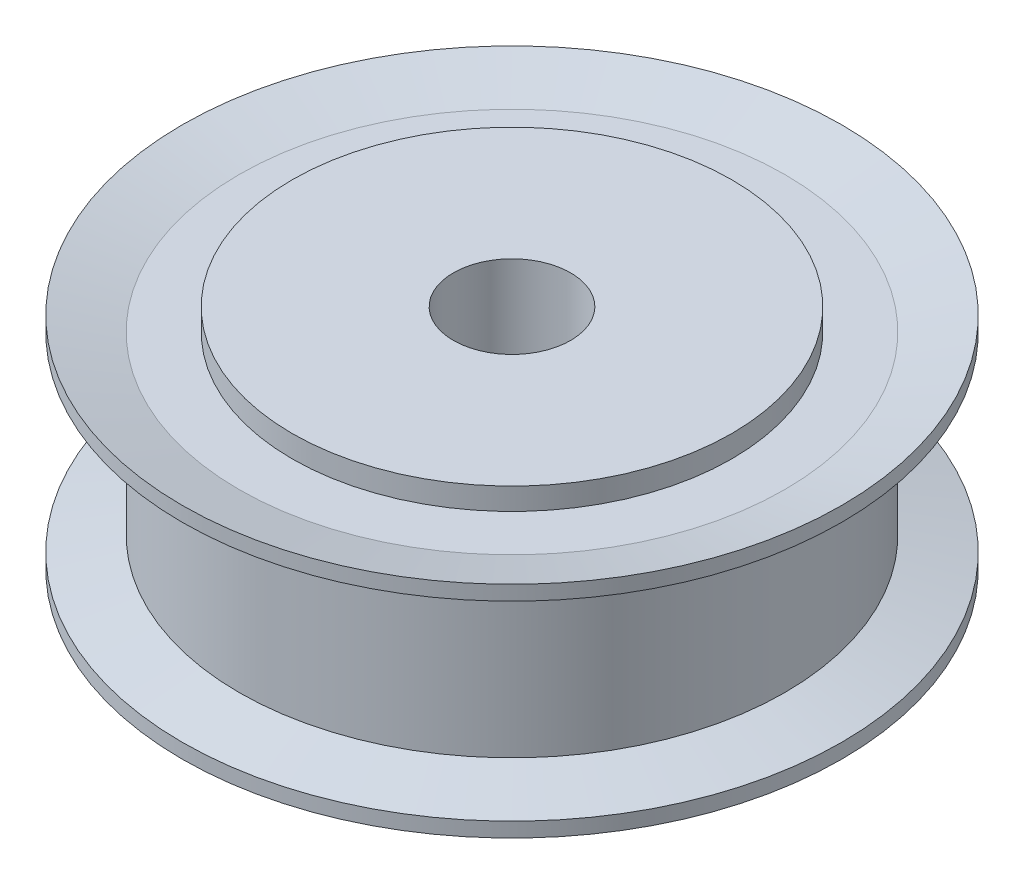
ISO-10303-21;
HEADER;
FILE_DESCRIPTION(('STEP AP214'),'2;1');
FILE_NAME('part.step','',(''),(''),'','','');
FILE_SCHEMA(('AUTOMOTIVE_DESIGN { 1 0 10303 214 1 1 1 1 }'));
ENDSEC;
DATA;
#1=APPLICATION_CONTEXT('core data for automotive mechanical design processes');
#2=APPLICATION_PROTOCOL_DEFINITION('international standard','automotive_design',2000,#1);
#3=PRODUCT_CONTEXT('',#1,'mechanical');
#4=PRODUCT('Part','Part','',(#3));
#5=PRODUCT_RELATED_PRODUCT_CATEGORY('part','',(#4));
#6=PRODUCT_DEFINITION_FORMATION('','',#4);
#7=PRODUCT_DEFINITION_CONTEXT('part definition',#1,'design');
#8=PRODUCT_DEFINITION('design','',#6,#7);
#9=PRODUCT_DEFINITION_SHAPE('','',#8);
#10=(LENGTH_UNIT() NAMED_UNIT(*) SI_UNIT(.MILLI.,.METRE.));
#11=(NAMED_UNIT(*) PLANE_ANGLE_UNIT() SI_UNIT($,.RADIAN.));
#12=(NAMED_UNIT(*) SI_UNIT($,.STERADIAN.) SOLID_ANGLE_UNIT());
#13=UNCERTAINTY_MEASURE_WITH_UNIT(LENGTH_MEASURE(1.E-05),#10,'distance_accuracy_value','');
#14=(GEOMETRIC_REPRESENTATION_CONTEXT(3) GLOBAL_UNCERTAINTY_ASSIGNED_CONTEXT((#13)) GLOBAL_UNIT_ASSIGNED_CONTEXT((#10,
#11,#12)) REPRESENTATION_CONTEXT('',''));
#15=CARTESIAN_POINT('',(0.,0.,0.));
#16=DIRECTION('',(0.,0.,1.));
#17=DIRECTION('',(1.,0.,0.));
#18=AXIS2_PLACEMENT_3D('',#15,#16,#17);
#19=CARTESIAN_POINT('',(0.,49.340027700831,0.));
#20=DIRECTION('',(0.,1.,0.));
#21=DIRECTION('',(0.,0.,1.));
#22=AXIS2_PLACEMENT_3D('',#19,#20,#21);
#23=CYLINDRICAL_SURFACE('',#22,15.);
#24=CARTESIAN_POINT('',(0.,8.,0.));
#25=DIRECTION('',(0.,1.,0.));
#26=DIRECTION('',(0.,0.,1.));
#27=AXIS2_PLACEMENT_3D('',#24,#25,#26);
#28=CIRCLE('',#27,15.);
#29=CARTESIAN_POINT('',(0.,8.,15.));
#30=VERTEX_POINT('',#29);
#31=EDGE_CURVE('E41',#30,#30,#28,.T.);
#32=ORIENTED_EDGE('',*,*,#31,.F.);
#33=EDGE_LOOP('',(#32));
#34=FACE_BOUND('',#33,.T.);
#35=CARTESIAN_POINT('',(0.,6.50000000000001,0.));
#36=DIRECTION('',(0.,-1.,0.));
#37=DIRECTION('',(1.,0.,0.));
#38=AXIS2_PLACEMENT_3D('',#35,#36,#37);
#39=CIRCLE('',#38,15.);
#40=CARTESIAN_POINT('',(15.,6.50000000000001,0.));
#41=VERTEX_POINT('',#40);
#42=EDGE_CURVE('E10',#41,#41,#39,.T.);
#43=ORIENTED_EDGE('',*,*,#42,.F.);
#44=EDGE_LOOP('',(#43));
#45=FACE_BOUND('',#44,.T.);
#46=ADVANCED_FACE('F30',(#34,#45),#23,.T.);
#47=CARTESIAN_POINT('',(0.,49.340027700831,0.));
#48=DIRECTION('',(0.,1.,0.));
#49=DIRECTION('',(0.,0.,1.));
#50=AXIS2_PLACEMENT_3D('',#47,#48,#49);
#51=CYLINDRICAL_SURFACE('',#50,15.);
#52=CARTESIAN_POINT('',(0.,-8.,0.));
#53=DIRECTION('',(0.,1.,0.));
#54=DIRECTION('',(0.,0.,1.));
#55=AXIS2_PLACEMENT_3D('',#52,#53,#54);
#56=CIRCLE('',#55,15.);
#57=CARTESIAN_POINT('',(0.,-8.,15.));
#58=VERTEX_POINT('',#57);
#59=EDGE_CURVE('E50',#58,#58,#56,.T.);
#60=ORIENTED_EDGE('',*,*,#59,.T.);
#61=EDGE_LOOP('',(#60));
#62=FACE_BOUND('',#61,.T.);
#63=CARTESIAN_POINT('',(0.,-6.50000000000001,0.));
#64=DIRECTION('',(0.,1.,0.));
#65=DIRECTION('',(-1.,0.,0.));
#66=AXIS2_PLACEMENT_3D('',#63,#64,#65);
#67=CIRCLE('',#66,15.);
#68=CARTESIAN_POINT('',(-15.,-6.50000000000001,0.));
#69=VERTEX_POINT('',#68);
#70=EDGE_CURVE('E37',#69,#69,#67,.T.);
#71=ORIENTED_EDGE('',*,*,#70,.F.);
#72=EDGE_LOOP('',(#71));
#73=FACE_BOUND('',#72,.T.);
#74=ADVANCED_FACE('F95',(#62,#73),#51,.T.);
#75=CARTESIAN_POINT('',(15.,8.,0.));
#76=DIRECTION('',(0.,-1.,0.));
#77=DIRECTION('',(0.,0.,-1.));
#78=AXIS2_PLACEMENT_3D('',#75,#76,#77);
#79=PLANE('',#78);
#80=CARTESIAN_POINT('',(0.,7.99999999999999,0.));
#81=DIRECTION('',(0.,1.,0.));
#82=DIRECTION('',(0.,0.,1.));
#83=AXIS2_PLACEMENT_3D('',#80,#81,#82);
#84=CIRCLE('',#83,4.00000000000001);
#85=CARTESIAN_POINT('',(0.,7.99999999999999,4.00000000000001));
#86=VERTEX_POINT('',#85);
#87=EDGE_CURVE('E56',#86,#86,#84,.T.);
#88=ORIENTED_EDGE('',*,*,#87,.F.);
#89=EDGE_LOOP('',(#88));
#90=FACE_BOUND('',#89,.T.);
#91=ORIENTED_EDGE('',*,*,#31,.T.);
#92=EDGE_LOOP('',(#91));
#93=FACE_BOUND('',#92,.T.);
#94=ADVANCED_FACE('F32',(#90,#93),#79,.F.);
#95=CARTESIAN_POINT('',(0.,49.340027700831,0.));
#96=DIRECTION('',(0.,1.,0.));
#97=DIRECTION('',(0.,0.,1.));
#98=AXIS2_PLACEMENT_3D('',#95,#96,#97);
#99=CYLINDRICAL_SURFACE('',#98,18.62);
#100=CARTESIAN_POINT('',(0.,5.5,0.));
#101=DIRECTION('',(0.,1.,0.));
#102=DIRECTION('',(0.,0.,1.));
#103=AXIS2_PLACEMENT_3D('',#100,#101,#102);
#104=CIRCLE('',#103,18.62);
#105=CARTESIAN_POINT('',(0.,5.5,18.62));
#106=VERTEX_POINT('',#105);
#107=EDGE_CURVE('E45',#106,#106,#104,.T.);
#108=ORIENTED_EDGE('',*,*,#107,.F.);
#109=EDGE_LOOP('',(#108));
#110=FACE_BOUND('',#109,.T.);
#111=CARTESIAN_POINT('',(0.,-5.5,0.));
#112=DIRECTION('',(0.,-1.,0.));
#113=DIRECTION('',(1.,0.,0.));
#114=AXIS2_PLACEMENT_3D('',#111,#112,#113);
#115=CIRCLE('',#114,18.62);
#116=CARTESIAN_POINT('',(18.62,-5.5,0.));
#117=VERTEX_POINT('',#116);
#118=EDGE_CURVE('E62',#117,#117,#115,.T.);
#119=ORIENTED_EDGE('',*,*,#118,.F.);
#120=EDGE_LOOP('',(#119));
#121=FACE_BOUND('',#120,.T.);
#122=ADVANCED_FACE('F105',(#110,#121),#99,.T.);
#123=CARTESIAN_POINT('',(15.,-8.,0.));
#124=DIRECTION('',(0.,1.,0.));
#125=DIRECTION('',(0.,0.,1.));
#126=AXIS2_PLACEMENT_3D('',#123,#124,#125);
#127=PLANE('',#126);
#128=ORIENTED_EDGE('',*,*,#59,.F.);
#129=EDGE_LOOP('',(#128));
#130=FACE_BOUND('',#129,.T.);
#131=CARTESIAN_POINT('',(0.,-8.,0.));
#132=DIRECTION('',(0.,1.,0.));
#133=DIRECTION('',(0.,0.,1.));
#134=AXIS2_PLACEMENT_3D('',#131,#132,#133);
#135=CIRCLE('',#134,4.00000000000001);
#136=CARTESIAN_POINT('',(0.,-8.,4.00000000000001));
#137=VERTEX_POINT('',#136);
#138=EDGE_CURVE('E53',#137,#137,#135,.T.);
#139=ORIENTED_EDGE('',*,*,#138,.T.);
#140=EDGE_LOOP('',(#139));
#141=FACE_BOUND('',#140,.T.);
#142=ADVANCED_FACE('F107',(#130,#141),#127,.F.);
#143=CARTESIAN_POINT('',(0.,49.340027700831,0.));
#144=DIRECTION('',(0.,1.,0.));
#145=DIRECTION('',(0.,0.,1.));
#146=AXIS2_PLACEMENT_3D('',#143,#144,#145);
#147=CYLINDRICAL_SURFACE('',#146,4.00000000000001);
#148=ORIENTED_EDGE('',*,*,#138,.F.);
#149=EDGE_LOOP('',(#148));
#150=FACE_BOUND('',#149,.T.);
#151=ORIENTED_EDGE('',*,*,#87,.T.);
#152=EDGE_LOOP('',(#151));
#153=FACE_BOUND('',#152,.T.);
#154=ADVANCED_FACE('F112',(#150,#153),#147,.F.);
#155=CARTESIAN_POINT('',(0.,0.,0.));
#156=DIRECTION('',(0.,-1.,0.));
#157=DIRECTION('',(1.,0.,0.));
#158=AXIS2_PLACEMENT_3D('',#155,#156,#157);
#159=CYLINDRICAL_SURFACE('',#158,22.5);
#160=CARTESIAN_POINT('',(0.,-7.5,0.));
#161=DIRECTION('',(0.,-1.,0.));
#162=DIRECTION('',(1.,0.,0.));
#163=AXIS2_PLACEMENT_3D('',#160,#161,#162);
#164=CIRCLE('',#163,22.5);
#165=CARTESIAN_POINT('',(22.5,-7.5,0.));
#166=VERTEX_POINT('',#165);
#167=EDGE_CURVE('E68',#166,#166,#164,.T.);
#168=ORIENTED_EDGE('',*,*,#167,.F.);
#169=EDGE_LOOP('',(#168));
#170=FACE_BOUND('',#169,.T.);
#171=CARTESIAN_POINT('',(0.,-6.5,0.));
#172=DIRECTION('',(0.,-1.,0.));
#173=DIRECTION('',(1.,0.,0.));
#174=AXIS2_PLACEMENT_3D('',#171,#172,#173);
#175=CIRCLE('',#174,22.5);
#176=CARTESIAN_POINT('',(22.5,-6.5,0.));
#177=VERTEX_POINT('',#176);
#178=EDGE_CURVE('E59',#177,#177,#175,.T.);
#179=ORIENTED_EDGE('',*,*,#178,.T.);
#180=EDGE_LOOP('',(#179));
#181=FACE_BOUND('',#180,.T.);
#182=ADVANCED_FACE('F116',(#170,#181),#159,.T.);
#183=CARTESIAN_POINT('',(0.,-5.5,0.));
#184=DIRECTION('',(0.,-1.,0.));
#185=DIRECTION('',(1.,0.,0.));
#186=AXIS2_PLACEMENT_3D('',#183,#184,#185);
#187=CONICAL_SURFACE('',#186,18.62,1.31855386890508);
#188=ORIENTED_EDGE('',*,*,#178,.F.);
#189=EDGE_LOOP('',(#188));
#190=FACE_BOUND('',#189,.T.);
#191=ORIENTED_EDGE('',*,*,#118,.T.);
#192=EDGE_LOOP('',(#191));
#193=FACE_BOUND('',#192,.T.);
#194=ADVANCED_FACE('F120',(#190,#193),#187,.T.);
#195=CARTESIAN_POINT('',(-18.62,-6.5,0.));
#196=DIRECTION('',(0.,1.,0.));
#197=DIRECTION('',(-1.,0.,0.));
#198=AXIS2_PLACEMENT_3D('',#195,#196,#197);
#199=PLANE('',#198);
#200=ORIENTED_EDGE('',*,*,#70,.T.);
#201=EDGE_LOOP('',(#200));
#202=FACE_BOUND('',#201,.T.);
#203=CARTESIAN_POINT('',(0.,-6.5,0.));
#204=DIRECTION('',(0.,-1.,0.));
#205=DIRECTION('',(1.,0.,0.));
#206=AXIS2_PLACEMENT_3D('',#203,#204,#205);
#207=CIRCLE('',#206,18.62);
#208=CARTESIAN_POINT('',(18.62,-6.5,0.));
#209=VERTEX_POINT('',#208);
#210=EDGE_CURVE('E65',#209,#209,#207,.T.);
#211=ORIENTED_EDGE('',*,*,#210,.T.);
#212=EDGE_LOOP('',(#211));
#213=FACE_BOUND('',#212,.T.);
#214=ADVANCED_FACE('F124',(#202,#213),#199,.F.);
#215=CARTESIAN_POINT('',(0.,-7.5,0.));
#216=DIRECTION('',(0.,-1.,0.));
#217=DIRECTION('',(1.,0.,0.));
#218=AXIS2_PLACEMENT_3D('',#215,#216,#217);
#219=CONICAL_SURFACE('',#218,22.5,1.31855386890508);
#220=ORIENTED_EDGE('',*,*,#210,.F.);
#221=EDGE_LOOP('',(#220));
#222=FACE_BOUND('',#221,.T.);
#223=ORIENTED_EDGE('',*,*,#167,.T.);
#224=EDGE_LOOP('',(#223));
#225=FACE_BOUND('',#224,.T.);
#226=ADVANCED_FACE('F128',(#222,#225),#219,.F.);
#227=CARTESIAN_POINT('',(0.,0.,0.));
#228=DIRECTION('',(0.,1.,0.));
#229=DIRECTION('',(1.,0.,0.));
#230=AXIS2_PLACEMENT_3D('',#227,#228,#229);
#231=CYLINDRICAL_SURFACE('',#230,22.5);
#232=CARTESIAN_POINT('',(0.,7.5,0.));
#233=DIRECTION('',(0.,-1.,0.));
#234=DIRECTION('',(1.,0.,0.));
#235=AXIS2_PLACEMENT_3D('',#232,#233,#234);
#236=CIRCLE('',#235,22.5);
#237=CARTESIAN_POINT('',(22.5,7.5,0.));
#238=VERTEX_POINT('',#237);
#239=EDGE_CURVE('E77',#238,#238,#236,.T.);
#240=ORIENTED_EDGE('',*,*,#239,.T.);
#241=EDGE_LOOP('',(#240));
#242=FACE_BOUND('',#241,.T.);
#243=CARTESIAN_POINT('',(0.,6.5,0.));
#244=DIRECTION('',(0.,-1.,0.));
#245=DIRECTION('',(1.,0.,0.));
#246=AXIS2_PLACEMENT_3D('',#243,#244,#245);
#247=CIRCLE('',#246,22.5);
#248=CARTESIAN_POINT('',(22.5,6.5,0.));
#249=VERTEX_POINT('',#248);
#250=EDGE_CURVE('E71',#249,#249,#247,.T.);
#251=ORIENTED_EDGE('',*,*,#250,.F.);
#252=EDGE_LOOP('',(#251));
#253=FACE_BOUND('',#252,.T.);
#254=ADVANCED_FACE('F81',(#242,#253),#231,.T.);
#255=CARTESIAN_POINT('',(0.,5.5,0.));
#256=DIRECTION('',(0.,1.,0.));
#257=DIRECTION('',(1.,0.,0.));
#258=AXIS2_PLACEMENT_3D('',#255,#256,#257);
#259=CONICAL_SURFACE('',#258,18.62,1.31855386890508);
#260=ORIENTED_EDGE('',*,*,#250,.T.);
#261=EDGE_LOOP('',(#260));
#262=FACE_BOUND('',#261,.T.);
#263=ORIENTED_EDGE('',*,*,#107,.T.);
#264=EDGE_LOOP('',(#263));
#265=FACE_BOUND('',#264,.T.);
#266=ADVANCED_FACE('F92',(#262,#265),#259,.T.);
#267=CARTESIAN_POINT('',(-18.62,6.5,0.));
#268=DIRECTION('',(0.,-1.,0.));
#269=DIRECTION('',(-1.,0.,0.));
#270=AXIS2_PLACEMENT_3D('',#267,#268,#269);
#271=PLANE('',#270);
#272=ORIENTED_EDGE('',*,*,#42,.T.);
#273=EDGE_LOOP('',(#272));
#274=FACE_BOUND('',#273,.T.);
#275=CARTESIAN_POINT('',(0.,6.5,0.));
#276=DIRECTION('',(0.,-1.,0.));
#277=DIRECTION('',(1.,0.,0.));
#278=AXIS2_PLACEMENT_3D('',#275,#276,#277);
#279=CIRCLE('',#278,18.62);
#280=CARTESIAN_POINT('',(18.62,6.5,0.));
#281=VERTEX_POINT('',#280);
#282=EDGE_CURVE('E74',#281,#281,#279,.T.);
#283=ORIENTED_EDGE('',*,*,#282,.F.);
#284=EDGE_LOOP('',(#283));
#285=FACE_BOUND('',#284,.T.);
#286=ADVANCED_FACE('F86',(#274,#285),#271,.F.);
#287=CARTESIAN_POINT('',(0.,7.5,0.));
#288=DIRECTION('',(0.,1.,0.));
#289=DIRECTION('',(1.,0.,0.));
#290=AXIS2_PLACEMENT_3D('',#287,#288,#289);
#291=CONICAL_SURFACE('',#290,22.5,1.31855386890508);
#292=ORIENTED_EDGE('',*,*,#282,.T.);
#293=EDGE_LOOP('',(#292));
#294=FACE_BOUND('',#293,.T.);
#295=ORIENTED_EDGE('',*,*,#239,.F.);
#296=EDGE_LOOP('',(#295));
#297=FACE_BOUND('',#296,.T.);
#298=ADVANCED_FACE('F84',(#294,#297),#291,.F.);
#299=CLOSED_SHELL('',(#46,#74,#94,#122,#142,#154,#182,#194,#214,#226,#254,#266,#286,#298));
#300=MANIFOLD_SOLID_BREP('B2',#299);
#301=ADVANCED_BREP_SHAPE_REPRESENTATION('',(#18,#300),#14);
#302=SHAPE_DEFINITION_REPRESENTATION(#9,#301);
ENDSEC;
END-ISO-10303-21;
